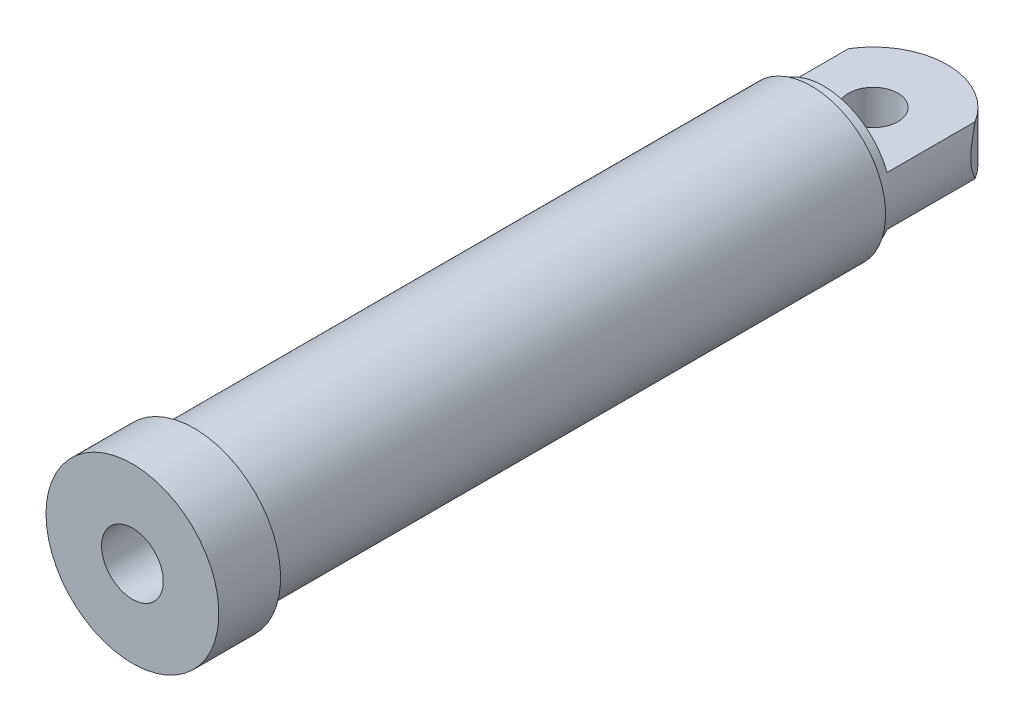
ISO-10303-21;
HEADER;
FILE_DESCRIPTION(('STEP AP214'),'2;1');
FILE_NAME('part.step','',(''),(''),'','','');
FILE_SCHEMA(('AUTOMOTIVE_DESIGN { 1 0 10303 214 1 1 1 1 }'));
ENDSEC;
DATA;
#1=APPLICATION_CONTEXT('core data for automotive mechanical design processes');
#2=APPLICATION_PROTOCOL_DEFINITION('international standard','automotive_design',2000,#1);
#3=PRODUCT_CONTEXT('',#1,'mechanical');
#4=PRODUCT('Part','Part','',(#3));
#5=PRODUCT_RELATED_PRODUCT_CATEGORY('part','',(#4));
#6=PRODUCT_DEFINITION_FORMATION('','',#4);
#7=PRODUCT_DEFINITION_CONTEXT('part definition',#1,'design');
#8=PRODUCT_DEFINITION('design','',#6,#7);
#9=PRODUCT_DEFINITION_SHAPE('','',#8);
#10=(LENGTH_UNIT() NAMED_UNIT(*) SI_UNIT(.MILLI.,.METRE.));
#11=(NAMED_UNIT(*) PLANE_ANGLE_UNIT() SI_UNIT($,.RADIAN.));
#12=(NAMED_UNIT(*) SI_UNIT($,.STERADIAN.) SOLID_ANGLE_UNIT());
#13=UNCERTAINTY_MEASURE_WITH_UNIT(LENGTH_MEASURE(1.E-05),#10,'distance_accuracy_value','');
#14=(GEOMETRIC_REPRESENTATION_CONTEXT(3) GLOBAL_UNCERTAINTY_ASSIGNED_CONTEXT((#13)) GLOBAL_UNIT_ASSIGNED_CONTEXT((#10,
#11,#12)) REPRESENTATION_CONTEXT('',''));
#15=CARTESIAN_POINT('',(0.,0.,0.));
#16=DIRECTION('',(0.,0.,1.));
#17=DIRECTION('',(1.,0.,0.));
#18=AXIS2_PLACEMENT_3D('',#15,#16,#17);
#19=CARTESIAN_POINT('',(0.,0.,0.));
#20=DIRECTION('',(0.,0.,-1.));
#21=DIRECTION('',(-1.,0.,0.));
#22=AXIS2_PLACEMENT_3D('',#19,#20,#21);
#23=CYLINDRICAL_SURFACE('',#22,60.);
#24=CARTESIAN_POINT('',(0.,0.,550.));
#25=DIRECTION('',(0.,0.,-1.));
#26=DIRECTION('',(-1.,0.,0.));
#27=AXIS2_PLACEMENT_3D('',#24,#25,#26);
#28=CIRCLE('',#27,60.);
#29=CARTESIAN_POINT('',(-59.9999999999999,0.,550.));
#30=VERTEX_POINT('',#29);
#31=EDGE_CURVE('E93',#30,#30,#28,.T.);
#32=ORIENTED_EDGE('',*,*,#31,.T.);
#33=EDGE_LOOP('',(#32));
#34=FACE_BOUND('',#33,.T.);
#35=CARTESIAN_POINT('',(0.,0.,50.));
#36=DIRECTION('',(0.,0.,-1.));
#37=DIRECTION('',(-1.,0.,0.));
#38=AXIS2_PLACEMENT_3D('',#35,#36,#37);
#39=CIRCLE('',#38,60.);
#40=CARTESIAN_POINT('',(-60.,0.,50.));
#41=VERTEX_POINT('',#40);
#42=EDGE_CURVE('E40',#41,#41,#39,.T.);
#43=ORIENTED_EDGE('',*,*,#42,.F.);
#44=EDGE_LOOP('',(#43));
#45=FACE_BOUND('',#44,.T.);
#46=ADVANCED_FACE('F37',(#34,#45),#23,.T.);
#47=CARTESIAN_POINT('',(45.0000000000001,0.,60.));
#48=DIRECTION('',(0.,0.,-1.));
#49=DIRECTION('',(-1.,0.,0.));
#50=AXIS2_PLACEMENT_3D('',#47,#48,#49);
#51=PLANE('',#50);
#52=CARTESIAN_POINT('',(0.,0.,60.));
#53=DIRECTION('',(0.,0.,-1.));
#54=DIRECTION('',(-1.,0.,0.));
#55=AXIS2_PLACEMENT_3D('',#52,#53,#54);
#56=CIRCLE('',#55,45.0000000000001);
#57=CARTESIAN_POINT('',(-45.0000000000001,0.,60.));
#58=VERTEX_POINT('',#57);
#59=EDGE_CURVE('E120',#58,#58,#56,.T.);
#60=ORIENTED_EDGE('',*,*,#59,.F.);
#61=EDGE_LOOP('',(#60));
#62=FACE_BOUND('',#61,.T.);
#63=ADVANCED_FACE('F161',(#62),#51,.F.);
#64=CARTESIAN_POINT('',(0.,0.,0.));
#65=DIRECTION('',(0.,0.,-1.));
#66=DIRECTION('',(-1.,0.,0.));
#67=AXIS2_PLACEMENT_3D('',#64,#65,#66);
#68=CYLINDRICAL_SURFACE('',#67,45.);
#69=CARTESIAN_POINT('',(0.,0.,520.));
#70=DIRECTION('',(0.,0.,-1.));
#71=DIRECTION('',(-1.,0.,0.));
#72=AXIS2_PLACEMENT_3D('',#69,#70,#71);
#73=CIRCLE('',#72,45.);
#74=CARTESIAN_POINT('',(-44.9999999999999,0.,520.));
#75=VERTEX_POINT('',#74);
#76=EDGE_CURVE('E117',#75,#75,#73,.T.);
#77=ORIENTED_EDGE('',*,*,#76,.F.);
#78=EDGE_LOOP('',(#77));
#79=FACE_BOUND('',#78,.T.);
#80=ORIENTED_EDGE('',*,*,#59,.T.);
#81=EDGE_LOOP('',(#80));
#82=FACE_BOUND('',#81,.T.);
#83=ADVANCED_FACE('F166',(#79,#82),#68,.F.);
#84=CARTESIAN_POINT('',(25.0000000000001,0.,520.));
#85=DIRECTION('',(0.,0.,1.));
#86=DIRECTION('',(1.,0.,0.));
#87=AXIS2_PLACEMENT_3D('',#84,#85,#86);
#88=PLANE('',#87);
#89=CARTESIAN_POINT('',(0.,0.,520.));
#90=DIRECTION('',(0.,0.,-1.));
#91=DIRECTION('',(-1.,0.,0.));
#92=AXIS2_PLACEMENT_3D('',#89,#90,#91);
#93=CIRCLE('',#92,25.);
#94=CARTESIAN_POINT('',(-25.,0.,520.));
#95=VERTEX_POINT('',#94);
#96=EDGE_CURVE('E114',#95,#95,#93,.T.);
#97=ORIENTED_EDGE('',*,*,#96,.F.);
#98=EDGE_LOOP('',(#97));
#99=FACE_BOUND('',#98,.T.);
#100=ORIENTED_EDGE('',*,*,#76,.T.);
#101=EDGE_LOOP('',(#100));
#102=FACE_BOUND('',#101,.T.);
#103=ADVANCED_FACE('F204',(#99,#102),#88,.F.);
#104=CARTESIAN_POINT('',(0.,0.,0.));
#105=DIRECTION('',(0.,0.,-1.));
#106=DIRECTION('',(-1.,0.,0.));
#107=AXIS2_PLACEMENT_3D('',#104,#105,#106);
#108=CYLINDRICAL_SURFACE('',#107,25.);
#109=CARTESIAN_POINT('',(0.,0.,600.));
#110=DIRECTION('',(0.,0.,-1.));
#111=DIRECTION('',(-1.,0.,0.));
#112=AXIS2_PLACEMENT_3D('',#109,#110,#111);
#113=CIRCLE('',#112,25.);
#114=CARTESIAN_POINT('',(-24.9999999999999,0.,600.));
#115=VERTEX_POINT('',#114);
#116=EDGE_CURVE('E111',#115,#115,#113,.T.);
#117=ORIENTED_EDGE('',*,*,#116,.F.);
#118=EDGE_LOOP('',(#117));
#119=FACE_BOUND('',#118,.T.);
#120=ORIENTED_EDGE('',*,*,#96,.T.);
#121=EDGE_LOOP('',(#120));
#122=FACE_BOUND('',#121,.T.);
#123=ADVANCED_FACE('F208',(#119,#122),#108,.F.);
#124=CARTESIAN_POINT('',(70.0000000000001,0.,600.));
#125=DIRECTION('',(0.,0.,-1.));
#126=DIRECTION('',(-1.,0.,0.));
#127=AXIS2_PLACEMENT_3D('',#124,#125,#126);
#128=PLANE('',#127);
#129=CARTESIAN_POINT('',(0.,0.,600.));
#130=DIRECTION('',(0.,0.,-1.));
#131=DIRECTION('',(-1.,0.,0.));
#132=AXIS2_PLACEMENT_3D('',#129,#130,#131);
#133=CIRCLE('',#132,70.);
#134=CARTESIAN_POINT('',(-69.9999999999999,0.,600.));
#135=VERTEX_POINT('',#134);
#136=EDGE_CURVE('E108',#135,#135,#133,.T.);
#137=ORIENTED_EDGE('',*,*,#136,.F.);
#138=EDGE_LOOP('',(#137));
#139=FACE_BOUND('',#138,.T.);
#140=ORIENTED_EDGE('',*,*,#116,.T.);
#141=EDGE_LOOP('',(#140));
#142=FACE_BOUND('',#141,.T.);
#143=ADVANCED_FACE('F212',(#139,#142),#128,.F.);
#144=CARTESIAN_POINT('',(0.,0.,0.));
#145=DIRECTION('',(0.,0.,-1.));
#146=DIRECTION('',(-1.,0.,0.));
#147=AXIS2_PLACEMENT_3D('',#144,#145,#146);
#148=CYLINDRICAL_SURFACE('',#147,70.);
#149=CARTESIAN_POINT('',(0.,0.,550.));
#150=DIRECTION('',(0.,0.,-1.));
#151=DIRECTION('',(-1.,0.,0.));
#152=AXIS2_PLACEMENT_3D('',#149,#150,#151);
#153=CIRCLE('',#152,70.);
#154=CARTESIAN_POINT('',(-69.9999999999999,0.,550.));
#155=VERTEX_POINT('',#154);
#156=EDGE_CURVE('E97',#155,#155,#153,.T.);
#157=ORIENTED_EDGE('',*,*,#156,.F.);
#158=EDGE_LOOP('',(#157));
#159=FACE_BOUND('',#158,.T.);
#160=ORIENTED_EDGE('',*,*,#136,.T.);
#161=EDGE_LOOP('',(#160));
#162=FACE_BOUND('',#161,.T.);
#163=ADVANCED_FACE('F216',(#159,#162),#148,.T.);
#164=CARTESIAN_POINT('',(70.0000000000001,0.,550.));
#165=DIRECTION('',(0.,0.,1.));
#166=DIRECTION('',(1.,0.,0.));
#167=AXIS2_PLACEMENT_3D('',#164,#165,#166);
#168=PLANE('',#167);
#169=ORIENTED_EDGE('',*,*,#31,.F.);
#170=EDGE_LOOP('',(#169));
#171=FACE_BOUND('',#170,.T.);
#172=ORIENTED_EDGE('',*,*,#156,.T.);
#173=EDGE_LOOP('',(#172));
#174=FACE_BOUND('',#173,.T.);
#175=ADVANCED_FACE('F144',(#171,#174),#168,.F.);
#176=CARTESIAN_POINT('',(0.,0.,50.));
#177=DIRECTION('',(0.,0.,-1.));
#178=DIRECTION('',(-1.,0.,0.));
#179=AXIS2_PLACEMENT_3D('',#176,#177,#178);
#180=PLANE('',#179);
#181=CARTESIAN_POINT('',(0.,0.,50.));
#182=DIRECTION('',(0.,0.,-1.));
#183=DIRECTION('',(-1.,0.,0.));
#184=AXIS2_PLACEMENT_3D('',#181,#182,#183);
#185=CIRCLE('',#184,55.);
#186=CARTESIAN_POINT('',(-55.,0.,50.));
#187=VERTEX_POINT('',#186);
#188=EDGE_CURVE('E188',#187,#187,#185,.T.);
#189=ORIENTED_EDGE('',*,*,#188,.F.);
#190=EDGE_LOOP('',(#189));
#191=FACE_BOUND('',#190,.T.);
#192=ORIENTED_EDGE('',*,*,#42,.T.);
#193=EDGE_LOOP('',(#192));
#194=FACE_BOUND('',#193,.T.);
#195=ADVANCED_FACE('F139',(#191,#194),#180,.T.);
#196=CARTESIAN_POINT('',(0.,0.,50.));
#197=DIRECTION('',(0.,0.,-1.));
#198=DIRECTION('',(-1.,0.,0.));
#199=AXIS2_PLACEMENT_3D('',#196,#197,#198);
#200=CYLINDRICAL_SURFACE('',#199,55.);
#201=ORIENTED_EDGE('',*,*,#188,.T.);
#202=EDGE_LOOP('',(#201));
#203=FACE_BOUND('',#202,.T.);
#204=CARTESIAN_POINT('',(-51.234753829798,20.,-31.2249899919919));
#205=CARTESIAN_POINT('',(-51.3712103418228,19.6504237364978,-31.0010938328795));
#206=CARTESIAN_POINT('',(-51.5045010722681,19.2984175196761,-30.7790780288577));
#207=CARTESIAN_POINT('',(-51.7646776284598,18.5892682173008,-30.3394685057058));
#208=CARTESIAN_POINT('',(-51.8915628826439,18.2321246769833,-30.1218751822258));
#209=CARTESIAN_POINT('',(-52.2627851917116,17.1517340394822,-29.4762232921029));
#210=CARTESIAN_POINT('',(-52.4973346402981,16.4204317204274,-29.0558766833022));
#211=CARTESIAN_POINT('',(-52.9438002271502,14.9191174032238,-28.2343246571702));
#212=CARTESIAN_POINT('',(-53.1551453959298,14.148616962826,-27.8336977894913));
#213=CARTESIAN_POINT('',(-53.5476985578258,12.5815736915443,-27.0707928493247));
#214=CARTESIAN_POINT('',(-53.7289198957763,11.7850425803651,-26.7084978218561));
#215=CARTESIAN_POINT('',(-54.0320486449519,10.2964403032531,-26.0890146093488));
#216=CARTESIAN_POINT('',(-54.1588093516962,9.60850208399527,-25.824319564569));
#217=CARTESIAN_POINT('',(-54.3878807602413,8.21328418298736,-25.3383236994417));
#218=CARTESIAN_POINT('',(-54.4901915331757,7.50600455751513,-25.1170227528453));
#219=CARTESIAN_POINT('',(-54.6676594152826,6.079414602545,-24.728373986342));
#220=CARTESIAN_POINT('',(-54.7430277551137,5.36024628748654,-24.560607619583));
#221=CARTESIAN_POINT('',(-54.8658161359943,3.90805134142374,-24.2850814531454));
#222=CARTESIAN_POINT('',(-54.9132396611083,3.17502644977659,-24.1773141730769));
#223=CARTESIAN_POINT('',(-54.9790922993348,1.69071815352413,-24.0272020410826));
#224=CARTESIAN_POINT('',(-54.9971160006449,0.939322146177825,-23.9857720949582));
#225=CARTESIAN_POINT('',(-55.0022441114968,-0.564122307132695,-23.974010795699));
#226=CARTESIAN_POINT('',(-54.9893491524318,-1.31617073946016,-24.0036779906824));
#227=CARTESIAN_POINT('',(-54.933030345018,-2.81547449110806,-24.1322803420913));
#228=CARTESIAN_POINT('',(-54.8895092852759,-3.56270688150815,-24.2314360603559));
#229=CARTESIAN_POINT('',(-54.7732967602278,-5.04362627676651,-24.4929825623701));
#230=CARTESIAN_POINT('',(-54.7005991865704,-5.7773104115164,-24.6553865874797));
#231=CARTESIAN_POINT('',(-54.5055023316134,-7.41600648368185,-25.0842378146332));
#232=CARTESIAN_POINT('',(-54.3750869446152,-8.31582405094968,-25.366770913127));
#233=CARTESIAN_POINT('',(-54.0750770237305,-10.0842285671677,-26.0001633436826));
#234=CARTESIAN_POINT('',(-53.905463062673,-10.9527997826453,-26.3510565420488));
#235=CARTESIAN_POINT('',(-53.5300769735132,-12.6608560434831,-27.1055121659923));
#236=CARTESIAN_POINT('',(-53.3242218928405,-13.5002689540104,-27.5091948645809));
#237=CARTESIAN_POINT('',(-52.8792385885377,-15.1497743587683,-28.3551495939166));
#238=CARTESIAN_POINT('',(-52.6401204697679,-15.9598756636414,-28.7974098901525));
#239=CARTESIAN_POINT('',(-52.207951260875,-17.3109334351971,-29.5713066295323));
#240=CARTESIAN_POINT('',(-52.0230363606781,-17.8587485796701,-29.8956334935264));
#241=CARTESIAN_POINT('',(-51.639340122877,-18.9395084157563,-30.5536154642438));
#242=CARTESIAN_POINT('',(-51.4406371557238,-19.4725163514551,-30.8872122757043));
#243=CARTESIAN_POINT('',(-51.234753829798,-20.,-31.2249899919919));
#244=B_SPLINE_CURVE_WITH_KNOTS('',3,(#204,#205,#206,#207,#208,#209,#210,#211,#212,#213,#214,
#215,#216,#217,#218,#219,#220,#221,#222,#223,#224,#225,#226,#227,#228,#229,#230,#231,#232,#233,
#234,#235,#236,#237,#238,#239,#240,#241,#242,#243),.UNSPECIFIED.,.F.,.F.,(4,2,2,2,2,2,2,2,2,2,2,
2,2,2,2,2,2,2,2,4),(0.,1.31090200495055,2.62192077599482,5.24735611740963,7.92729682701593,
10.6060471425754,12.84821496436,15.0903762627869,17.3145520049003,19.5384503856338,
21.7927638622824,24.0470313037586,26.3084865603976,28.570415519115,31.4219764528141,
34.2749536884494,37.1345481013978,39.9932756977515,41.981735899764,43.9596969653085),.UNSPECIFIED.);
#245=CARTESIAN_POINT('',(-51.234753829798,20.,-31.2249899919919));
#246=VERTEX_POINT('',#245);
#247=CARTESIAN_POINT('',(-51.234753829798,-20.,-31.2249899919919));
#248=VERTEX_POINT('',#247);
#249=EDGE_CURVE('E11',#246,#248,#244,.T.);
#250=ORIENTED_EDGE('',*,*,#249,.T.);
#251=DIRECTION('',(0.,0.,-1.));
#252=VECTOR('',#251,1.);
#253=CARTESIAN_POINT('',(-51.234753829798,-20.,50.));
#254=LINE('',#253,#252);
#255=CARTESIAN_POINT('',(-51.234753829798,-20.,40.));
#256=VERTEX_POINT('',#255);
#257=EDGE_CURVE('E175',#248,#256,#254,.F.);
#258=ORIENTED_EDGE('',*,*,#257,.T.);
#259=CARTESIAN_POINT('',(0.,0.,40.));
#260=DIRECTION('',(0.,0.,1.));
#261=DIRECTION('',(1.,0.,0.));
#262=AXIS2_PLACEMENT_3D('',#259,#260,#261);
#263=CIRCLE('',#262,55.);
#264=CARTESIAN_POINT('',(51.234753829798,-20.,40.));
#265=VERTEX_POINT('',#264);
#266=EDGE_CURVE('E90',#256,#265,#263,.T.);
#267=ORIENTED_EDGE('',*,*,#266,.T.);
#268=DIRECTION('',(0.,0.,-1.));
#269=VECTOR('',#268,1.);
#270=CARTESIAN_POINT('',(51.234753829798,-20.,50.));
#271=LINE('',#270,#269);
#272=CARTESIAN_POINT('',(51.234753829798,-20.,-31.224989991992));
#273=VERTEX_POINT('',#272);
#274=EDGE_CURVE('E52',#265,#273,#271,.T.);
#275=ORIENTED_EDGE('',*,*,#274,.T.);
#276=CARTESIAN_POINT('',(51.234753829798,-20.,-31.224989991992));
#277=CARTESIAN_POINT('',(51.3712103418227,-19.6504237364978,-31.0010938328795));
#278=CARTESIAN_POINT('',(51.5045010722681,-19.2984175196761,-30.7790780288578));
#279=CARTESIAN_POINT('',(51.7646776284598,-18.5892682173008,-30.3394685057058));
#280=CARTESIAN_POINT('',(51.8915628826439,-18.2321246769833,-30.1218751822258));
#281=CARTESIAN_POINT('',(52.2627851917116,-17.1517340394822,-29.4762232921029));
#282=CARTESIAN_POINT('',(52.4973346402981,-16.4204317204274,-29.0558766833022));
#283=CARTESIAN_POINT('',(52.9438002271502,-14.9191174032238,-28.2343246571702));
#284=CARTESIAN_POINT('',(53.1551453959298,-14.148616962826,-27.8336977894913));
#285=CARTESIAN_POINT('',(53.5476985578258,-12.5815736915443,-27.0707928493247));
#286=CARTESIAN_POINT('',(53.7289198957763,-11.7850425803651,-26.7084978218561));
#287=CARTESIAN_POINT('',(54.0320486449519,-10.2964403032531,-26.0890146093488));
#288=CARTESIAN_POINT('',(54.1588093516962,-9.60850208399527,-25.824319564569));
#289=CARTESIAN_POINT('',(54.3878807602413,-8.21328418298737,-25.3383236994417));
#290=CARTESIAN_POINT('',(54.4901915331757,-7.50600455751514,-25.1170227528453));
#291=CARTESIAN_POINT('',(54.6676594152826,-6.07941460254501,-24.728373986342));
#292=CARTESIAN_POINT('',(54.7430277551137,-5.36024628748655,-24.560607619583));
#293=CARTESIAN_POINT('',(54.8658161359943,-3.90805134142375,-24.2850814531454));
#294=CARTESIAN_POINT('',(54.9132396611083,-3.1750264497766,-24.1773141730769));
#295=CARTESIAN_POINT('',(54.9790922993348,-1.69071815352414,-24.0272020410826));
#296=CARTESIAN_POINT('',(54.9971160006449,-0.939322146177828,-23.9857720949582));
#297=CARTESIAN_POINT('',(55.0022441114968,0.564122307132693,-23.974010795699));
#298=CARTESIAN_POINT('',(54.9893491524318,1.31617073946016,-24.0036779906824));
#299=CARTESIAN_POINT('',(54.933030345018,2.81547449110805,-24.1322803420913));
#300=CARTESIAN_POINT('',(54.8895092852759,3.56270688150814,-24.2314360603559));
#301=CARTESIAN_POINT('',(54.7732967602278,5.0436262767665,-24.4929825623701));
#302=CARTESIAN_POINT('',(54.7005991865704,5.7773104115164,-24.6553865874797));
#303=CARTESIAN_POINT('',(54.5055023316134,7.41600648368185,-25.0842378146331));
#304=CARTESIAN_POINT('',(54.3750869446152,8.31582405094967,-25.366770913127));
#305=CARTESIAN_POINT('',(54.0750770237305,10.0842285671677,-26.0001633436826));
#306=CARTESIAN_POINT('',(53.905463062673,10.9527997826453,-26.3510565420488));
#307=CARTESIAN_POINT('',(53.5300769735132,12.6608560434831,-27.1055121659923));
#308=CARTESIAN_POINT('',(53.3242218928405,13.5002689540104,-27.5091948645809));
#309=CARTESIAN_POINT('',(52.8792385885377,15.1497743587683,-28.3551495939166));
#310=CARTESIAN_POINT('',(52.6401204697679,15.9598756636414,-28.7974098901525));
#311=CARTESIAN_POINT('',(52.207951260875,17.3109334351971,-29.5713066295323));
#312=CARTESIAN_POINT('',(52.0230363606781,17.8587485796701,-29.8956334935264));
#313=CARTESIAN_POINT('',(51.639340122877,18.9395084157563,-30.5536154642438));
#314=CARTESIAN_POINT('',(51.4406371557238,19.4725163514551,-30.8872122757043));
#315=CARTESIAN_POINT('',(51.234753829798,20.,-31.2249899919919));
#316=B_SPLINE_CURVE_WITH_KNOTS('',3,(#276,#277,#278,#279,#280,#281,#282,#283,#284,#285,#286,
#287,#288,#289,#290,#291,#292,#293,#294,#295,#296,#297,#298,#299,#300,#301,#302,#303,#304,#305,
#306,#307,#308,#309,#310,#311,#312,#313,#314,#315),.UNSPECIFIED.,.F.,.F.,(4,2,2,2,2,2,2,2,2,2,2,
2,2,2,2,2,2,2,2,4),(0.,1.31090200495055,2.62192077599482,5.24735611740963,7.92729682701594,
10.6060471425754,12.84821496436,15.0903762627869,17.3145520049003,19.5384503856338,
21.7927638622824,24.0470313037586,26.3084865603976,28.570415519115,31.4219764528141,
34.2749536884494,37.1345481013978,39.9932756977515,41.9817358997641,43.9596969653085),.UNSPECIFIED.);
#317=CARTESIAN_POINT('',(51.234753829798,20.,-31.224989991992));
#318=VERTEX_POINT('',#317);
#319=EDGE_CURVE('E45',#273,#318,#316,.T.);
#320=ORIENTED_EDGE('',*,*,#319,.T.);
#321=DIRECTION('',(0.,0.,-1.));
#322=VECTOR('',#321,1.);
#323=CARTESIAN_POINT('',(51.234753829798,20.,50.));
#324=LINE('',#323,#322);
#325=CARTESIAN_POINT('',(51.234753829798,20.,40.));
#326=VERTEX_POINT('',#325);
#327=EDGE_CURVE('E75',#326,#318,#324,.T.);
#328=ORIENTED_EDGE('',*,*,#327,.F.);
#329=CARTESIAN_POINT('',(0.,0.,40.));
#330=DIRECTION('',(0.,0.,1.));
#331=DIRECTION('',(1.,0.,0.));
#332=AXIS2_PLACEMENT_3D('',#329,#330,#331);
#333=CIRCLE('',#332,55.);
#334=CARTESIAN_POINT('',(-51.234753829798,20.,40.));
#335=VERTEX_POINT('',#334);
#336=EDGE_CURVE('E177',#326,#335,#333,.T.);
#337=ORIENTED_EDGE('',*,*,#336,.T.);
#338=DIRECTION('',(0.,0.,-1.));
#339=VECTOR('',#338,1.);
#340=CARTESIAN_POINT('',(-51.234753829798,20.,50.));
#341=LINE('',#340,#339);
#342=EDGE_CURVE('E58',#246,#335,#341,.F.);
#343=ORIENTED_EDGE('',*,*,#342,.F.);
#344=EDGE_LOOP('',(#250,#258,#267,#275,#320,#328,#337,#343));
#345=FACE_BOUND('',#344,.T.);
#346=ADVANCED_FACE('F74',(#203,#345),#200,.T.);
#347=CARTESIAN_POINT('',(0.,20.,0.));
#348=DIRECTION('',(0.,-1.,0.));
#349=DIRECTION('',(0.,0.,-1.));
#350=AXIS2_PLACEMENT_3D('',#347,#348,#349);
#351=CYLINDRICAL_SURFACE('',#350,20.);
#352=CARTESIAN_POINT('',(0.,20.,0.));
#353=DIRECTION('',(0.,1.,0.));
#354=DIRECTION('',(0.,0.,1.));
#355=AXIS2_PLACEMENT_3D('',#352,#353,#354);
#356=CIRCLE('',#355,20.);
#357=CARTESIAN_POINT('',(0.,20.,20.));
#358=VERTEX_POINT('',#357);
#359=EDGE_CURVE('E99',#358,#358,#356,.T.);
#360=ORIENTED_EDGE('',*,*,#359,.T.);
#361=EDGE_LOOP('',(#360));
#362=FACE_BOUND('',#361,.T.);
#363=CARTESIAN_POINT('',(0.,-20.,0.));
#364=DIRECTION('',(0.,1.,0.));
#365=DIRECTION('',(0.,0.,1.));
#366=AXIS2_PLACEMENT_3D('',#363,#364,#365);
#367=CIRCLE('',#366,20.);
#368=CARTESIAN_POINT('',(0.,-20.,20.));
#369=VERTEX_POINT('',#368);
#370=EDGE_CURVE('E174',#369,#369,#367,.T.);
#371=ORIENTED_EDGE('',*,*,#370,.F.);
#372=EDGE_LOOP('',(#371));
#373=FACE_BOUND('',#372,.T.);
#374=ADVANCED_FACE('F138',(#362,#373),#351,.F.);
#375=CARTESIAN_POINT('',(0.,20.,0.));
#376=DIRECTION('',(0.,-1.,0.));
#377=DIRECTION('',(0.,0.,-1.));
#378=AXIS2_PLACEMENT_3D('',#375,#376,#377);
#379=CYLINDRICAL_SURFACE('',#378,60.);
#380=ORIENTED_EDGE('',*,*,#249,.F.);
#381=CARTESIAN_POINT('',(0.,20.,0.));
#382=DIRECTION('',(0.,1.,0.));
#383=DIRECTION('',(0.,0.,1.));
#384=AXIS2_PLACEMENT_3D('',#381,#382,#383);
#385=CIRCLE('',#384,60.);
#386=EDGE_CURVE('E87',#318,#246,#385,.T.);
#387=ORIENTED_EDGE('',*,*,#386,.F.);
#388=ORIENTED_EDGE('',*,*,#319,.F.);
#389=CARTESIAN_POINT('',(0.,-20.,0.));
#390=DIRECTION('',(0.,1.,0.));
#391=DIRECTION('',(0.,0.,1.));
#392=AXIS2_PLACEMENT_3D('',#389,#390,#391);
#393=CIRCLE('',#392,60.);
#394=EDGE_CURVE('E94',#273,#248,#393,.T.);
#395=ORIENTED_EDGE('',*,*,#394,.T.);
#396=EDGE_LOOP('',(#380,#387,#388,#395));
#397=FACE_BOUND('',#396,.T.);
#398=ADVANCED_FACE('F92',(#397),#379,.T.);
#399=CARTESIAN_POINT('',(0.,-20.,0.));
#400=DIRECTION('',(0.,1.,0.));
#401=DIRECTION('',(0.,0.,1.));
#402=AXIS2_PLACEMENT_3D('',#399,#400,#401);
#403=PLANE('',#402);
#404=ORIENTED_EDGE('',*,*,#370,.T.);
#405=EDGE_LOOP('',(#404));
#406=FACE_BOUND('',#405,.T.);
#407=ORIENTED_EDGE('',*,*,#274,.F.);
#408=DIRECTION('',(1.,0.,0.));
#409=VECTOR('',#408,1.);
#410=CARTESIAN_POINT('',(60.0000000000001,-20.,40.));
#411=LINE('',#410,#409);
#412=EDGE_CURVE('E81',#256,#265,#411,.T.);
#413=ORIENTED_EDGE('',*,*,#412,.F.);
#414=ORIENTED_EDGE('',*,*,#257,.F.);
#415=ORIENTED_EDGE('',*,*,#394,.F.);
#416=EDGE_LOOP('',(#407,#413,#414,#415));
#417=FACE_BOUND('',#416,.T.);
#418=ADVANCED_FACE('F151',(#406,#417),#403,.F.);
#419=CARTESIAN_POINT('',(0.,20.,0.));
#420=DIRECTION('',(0.,1.,0.));
#421=DIRECTION('',(0.,0.,1.));
#422=AXIS2_PLACEMENT_3D('',#419,#420,#421);
#423=PLANE('',#422);
#424=ORIENTED_EDGE('',*,*,#359,.F.);
#425=EDGE_LOOP('',(#424));
#426=FACE_BOUND('',#425,.T.);
#427=DIRECTION('',(1.,0.,0.));
#428=VECTOR('',#427,1.);
#429=CARTESIAN_POINT('',(60.0000000000001,20.,40.));
#430=LINE('',#429,#428);
#431=EDGE_CURVE('E89',#335,#326,#430,.T.);
#432=ORIENTED_EDGE('',*,*,#431,.T.);
#433=ORIENTED_EDGE('',*,*,#327,.T.);
#434=ORIENTED_EDGE('',*,*,#386,.T.);
#435=ORIENTED_EDGE('',*,*,#342,.T.);
#436=EDGE_LOOP('',(#432,#433,#434,#435));
#437=FACE_BOUND('',#436,.T.);
#438=ADVANCED_FACE('F86',(#426,#437),#423,.T.);
#439=CARTESIAN_POINT('',(60.0000000000001,0.,40.));
#440=DIRECTION('',(0.,0.,1.));
#441=DIRECTION('',(1.,0.,0.));
#442=AXIS2_PLACEMENT_3D('',#439,#440,#441);
#443=PLANE('',#442);
#444=ORIENTED_EDGE('',*,*,#266,.F.);
#445=ORIENTED_EDGE('',*,*,#412,.T.);
#446=EDGE_LOOP('',(#444,#445));
#447=FACE_BOUND('',#446,.T.);
#448=ADVANCED_FACE('F150',(#447),#443,.F.);
#449=ORIENTED_EDGE('',*,*,#336,.F.);
#450=ORIENTED_EDGE('',*,*,#431,.F.);
#451=EDGE_LOOP('',(#449,#450));
#452=FACE_BOUND('',#451,.T.);
#453=ADVANCED_FACE('F196',(#452),#443,.F.);
#454=CLOSED_SHELL('',(#46,#63,#83,#103,#123,#143,#163,#175,#195,#346,#374,#398,#418,#438,#448,#453));
#455=MANIFOLD_SOLID_BREP('B2',#454);
#456=ADVANCED_BREP_SHAPE_REPRESENTATION('',(#18,#455),#14);
#457=SHAPE_DEFINITION_REPRESENTATION(#9,#456);
ENDSEC;
END-ISO-10303-21;
